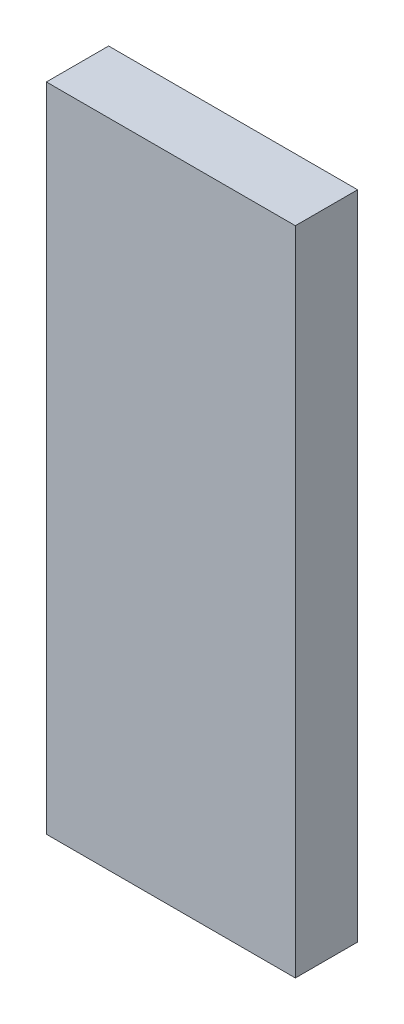
ISO-10303-21;
HEADER;
FILE_DESCRIPTION(('STEP AP214'),'2;1');
FILE_NAME('part.step','',(''),(''),'','','');
FILE_SCHEMA(('AUTOMOTIVE_DESIGN { 1 0 10303 214 1 1 1 1 }'));
ENDSEC;
DATA;
#1=APPLICATION_CONTEXT('core data for automotive mechanical design processes');
#2=APPLICATION_PROTOCOL_DEFINITION('international standard','automotive_design',2000,#1);
#3=PRODUCT_CONTEXT('',#1,'mechanical');
#4=PRODUCT('Part','Part','',(#3));
#5=PRODUCT_RELATED_PRODUCT_CATEGORY('part','',(#4));
#6=PRODUCT_DEFINITION_FORMATION('','',#4);
#7=PRODUCT_DEFINITION_CONTEXT('part definition',#1,'design');
#8=PRODUCT_DEFINITION('design','',#6,#7);
#9=PRODUCT_DEFINITION_SHAPE('','',#8);
#10=(LENGTH_UNIT() NAMED_UNIT(*) SI_UNIT(.MILLI.,.METRE.));
#11=(NAMED_UNIT(*) PLANE_ANGLE_UNIT() SI_UNIT($,.RADIAN.));
#12=(NAMED_UNIT(*) SI_UNIT($,.STERADIAN.) SOLID_ANGLE_UNIT());
#13=UNCERTAINTY_MEASURE_WITH_UNIT(LENGTH_MEASURE(1.E-05),#10,'distance_accuracy_value','');
#14=(GEOMETRIC_REPRESENTATION_CONTEXT(3) GLOBAL_UNCERTAINTY_ASSIGNED_CONTEXT((#13)) GLOBAL_UNIT_ASSIGNED_CONTEXT((#10,
#11,#12)) REPRESENTATION_CONTEXT('',''));
#15=CARTESIAN_POINT('',(0.,0.,0.));
#16=DIRECTION('',(0.,0.,1.));
#17=DIRECTION('',(1.,0.,0.));
#18=AXIS2_PLACEMENT_3D('',#15,#16,#17);
#19=CARTESIAN_POINT('',(0.,0.,15.));
#20=DIRECTION('',(1.,0.,0.));
#21=DIRECTION('',(0.,1.,0.));
#22=AXIS2_PLACEMENT_3D('',#19,#20,#21);
#23=PLANE('',#22);
#24=DIRECTION('',(0.,-1.,0.));
#25=VECTOR('',#24,1.);
#26=CARTESIAN_POINT('',(0.,0.,0.));
#27=LINE('',#26,#25);
#28=CARTESIAN_POINT('',(0.,157.,0.));
#29=VERTEX_POINT('',#28);
#30=CARTESIAN_POINT('',(0.,0.,0.));
#31=VERTEX_POINT('',#30);
#32=EDGE_CURVE('E99',#29,#31,#27,.T.);
#33=ORIENTED_EDGE('',*,*,#32,.T.);
#34=DIRECTION('',(0.,0.,-1.));
#35=VECTOR('',#34,1.);
#36=CARTESIAN_POINT('',(0.,0.,15.));
#37=LINE('',#36,#35);
#38=CARTESIAN_POINT('',(0.,0.,15.));
#39=VERTEX_POINT('',#38);
#40=EDGE_CURVE('E11',#39,#31,#37,.T.);
#41=ORIENTED_EDGE('',*,*,#40,.F.);
#42=DIRECTION('',(0.,-1.,0.));
#43=VECTOR('',#42,1.);
#44=CARTESIAN_POINT('',(0.,0.,15.));
#45=LINE('',#44,#43);
#46=CARTESIAN_POINT('',(0.,157.,15.));
#47=VERTEX_POINT('',#46);
#48=EDGE_CURVE('E87',#47,#39,#45,.T.);
#49=ORIENTED_EDGE('',*,*,#48,.F.);
#50=DIRECTION('',(0.,0.,-1.));
#51=VECTOR('',#50,1.);
#52=CARTESIAN_POINT('',(0.,157.,15.));
#53=LINE('',#52,#51);
#54=EDGE_CURVE('E95',#47,#29,#53,.T.);
#55=ORIENTED_EDGE('',*,*,#54,.T.);
#56=EDGE_LOOP('',(#33,#41,#49,#55));
#57=FACE_BOUND('',#56,.T.);
#58=ADVANCED_FACE('F36',(#57),#23,.F.);
#59=CARTESIAN_POINT('',(0.,0.,15.));
#60=DIRECTION('',(0.,1.,0.));
#61=DIRECTION('',(0.,0.,1.));
#62=AXIS2_PLACEMENT_3D('',#59,#60,#61);
#63=PLANE('',#62);
#64=DIRECTION('',(1.,0.,0.));
#65=VECTOR('',#64,1.);
#66=CARTESIAN_POINT('',(0.,0.,0.));
#67=LINE('',#66,#65);
#68=CARTESIAN_POINT('',(60.,0.,0.));
#69=VERTEX_POINT('',#68);
#70=EDGE_CURVE('E91',#31,#69,#67,.T.);
#71=ORIENTED_EDGE('',*,*,#70,.T.);
#72=DIRECTION('',(0.,0.,-1.));
#73=VECTOR('',#72,1.);
#74=CARTESIAN_POINT('',(60.,0.,15.));
#75=LINE('',#74,#73);
#76=CARTESIAN_POINT('',(60.,0.,15.));
#77=VERTEX_POINT('',#76);
#78=EDGE_CURVE('E44',#77,#69,#75,.T.);
#79=ORIENTED_EDGE('',*,*,#78,.F.);
#80=DIRECTION('',(1.,0.,0.));
#81=VECTOR('',#80,1.);
#82=CARTESIAN_POINT('',(0.,0.,15.));
#83=LINE('',#82,#81);
#84=EDGE_CURVE('E82',#39,#77,#83,.T.);
#85=ORIENTED_EDGE('',*,*,#84,.F.);
#86=ORIENTED_EDGE('',*,*,#40,.T.);
#87=EDGE_LOOP('',(#71,#79,#85,#86));
#88=FACE_BOUND('',#87,.T.);
#89=ADVANCED_FACE('F90',(#88),#63,.F.);
#90=CARTESIAN_POINT('',(60.,0.,15.));
#91=DIRECTION('',(-1.,0.,0.));
#92=DIRECTION('',(0.,-1.,0.));
#93=AXIS2_PLACEMENT_3D('',#90,#91,#92);
#94=PLANE('',#93);
#95=DIRECTION('',(0.,1.,0.));
#96=VECTOR('',#95,1.);
#97=CARTESIAN_POINT('',(60.,0.,0.));
#98=LINE('',#97,#96);
#99=CARTESIAN_POINT('',(60.,157.,0.));
#100=VERTEX_POINT('',#99);
#101=EDGE_CURVE('E69',#69,#100,#98,.T.);
#102=ORIENTED_EDGE('',*,*,#101,.T.);
#103=DIRECTION('',(0.,0.,-1.));
#104=VECTOR('',#103,1.);
#105=CARTESIAN_POINT('',(60.,157.,15.));
#106=LINE('',#105,#104);
#107=CARTESIAN_POINT('',(60.,157.,15.));
#108=VERTEX_POINT('',#107);
#109=EDGE_CURVE('E92',#108,#100,#106,.T.);
#110=ORIENTED_EDGE('',*,*,#109,.F.);
#111=DIRECTION('',(0.,1.,0.));
#112=VECTOR('',#111,1.);
#113=CARTESIAN_POINT('',(60.,0.,15.));
#114=LINE('',#113,#112);
#115=EDGE_CURVE('E85',#77,#108,#114,.T.);
#116=ORIENTED_EDGE('',*,*,#115,.F.);
#117=ORIENTED_EDGE('',*,*,#78,.T.);
#118=EDGE_LOOP('',(#102,#110,#116,#117));
#119=FACE_BOUND('',#118,.T.);
#120=ADVANCED_FACE('F93',(#119),#94,.F.);
#121=CARTESIAN_POINT('',(0.,157.,15.));
#122=DIRECTION('',(0.,-1.,0.));
#123=DIRECTION('',(0.,0.,-1.));
#124=AXIS2_PLACEMENT_3D('',#121,#122,#123);
#125=PLANE('',#124);
#126=DIRECTION('',(-1.,0.,0.));
#127=VECTOR('',#126,1.);
#128=CARTESIAN_POINT('',(0.,157.,0.));
#129=LINE('',#128,#127);
#130=EDGE_CURVE('E75',#100,#29,#129,.T.);
#131=ORIENTED_EDGE('',*,*,#130,.T.);
#132=ORIENTED_EDGE('',*,*,#54,.F.);
#133=DIRECTION('',(-1.,0.,0.));
#134=VECTOR('',#133,1.);
#135=CARTESIAN_POINT('',(0.,157.,15.));
#136=LINE('',#135,#134);
#137=EDGE_CURVE('E52',#108,#47,#136,.T.);
#138=ORIENTED_EDGE('',*,*,#137,.F.);
#139=ORIENTED_EDGE('',*,*,#109,.T.);
#140=EDGE_LOOP('',(#131,#132,#138,#139));
#141=FACE_BOUND('',#140,.T.);
#142=ADVANCED_FACE('F106',(#141),#125,.F.);
#143=CARTESIAN_POINT('',(0.,0.,15.));
#144=DIRECTION('',(0.,0.,-1.));
#145=DIRECTION('',(-1.,0.,0.));
#146=AXIS2_PLACEMENT_3D('',#143,#144,#145);
#147=PLANE('',#146);
#148=ORIENTED_EDGE('',*,*,#48,.T.);
#149=ORIENTED_EDGE('',*,*,#84,.T.);
#150=ORIENTED_EDGE('',*,*,#115,.T.);
#151=ORIENTED_EDGE('',*,*,#137,.T.);
#152=EDGE_LOOP('',(#148,#149,#150,#151));
#153=FACE_BOUND('',#152,.T.);
#154=ADVANCED_FACE('F83',(#153),#147,.F.);
#155=CARTESIAN_POINT('',(0.,0.,0.));
#156=DIRECTION('',(0.,0.,-1.));
#157=DIRECTION('',(-1.,0.,0.));
#158=AXIS2_PLACEMENT_3D('',#155,#156,#157);
#159=PLANE('',#158);
#160=ORIENTED_EDGE('',*,*,#32,.F.);
#161=ORIENTED_EDGE('',*,*,#130,.F.);
#162=ORIENTED_EDGE('',*,*,#101,.F.);
#163=ORIENTED_EDGE('',*,*,#70,.F.);
#164=EDGE_LOOP('',(#160,#161,#162,#163));
#165=FACE_BOUND('',#164,.T.);
#166=ADVANCED_FACE('F109',(#165),#159,.T.);
#167=CLOSED_SHELL('',(#58,#89,#120,#142,#154,#166));
#168=MANIFOLD_SOLID_BREP('B2',#167);
#169=ADVANCED_BREP_SHAPE_REPRESENTATION('',(#18,#168),#14);
#170=SHAPE_DEFINITION_REPRESENTATION(#9,#169);
ENDSEC;
END-ISO-10303-21;
